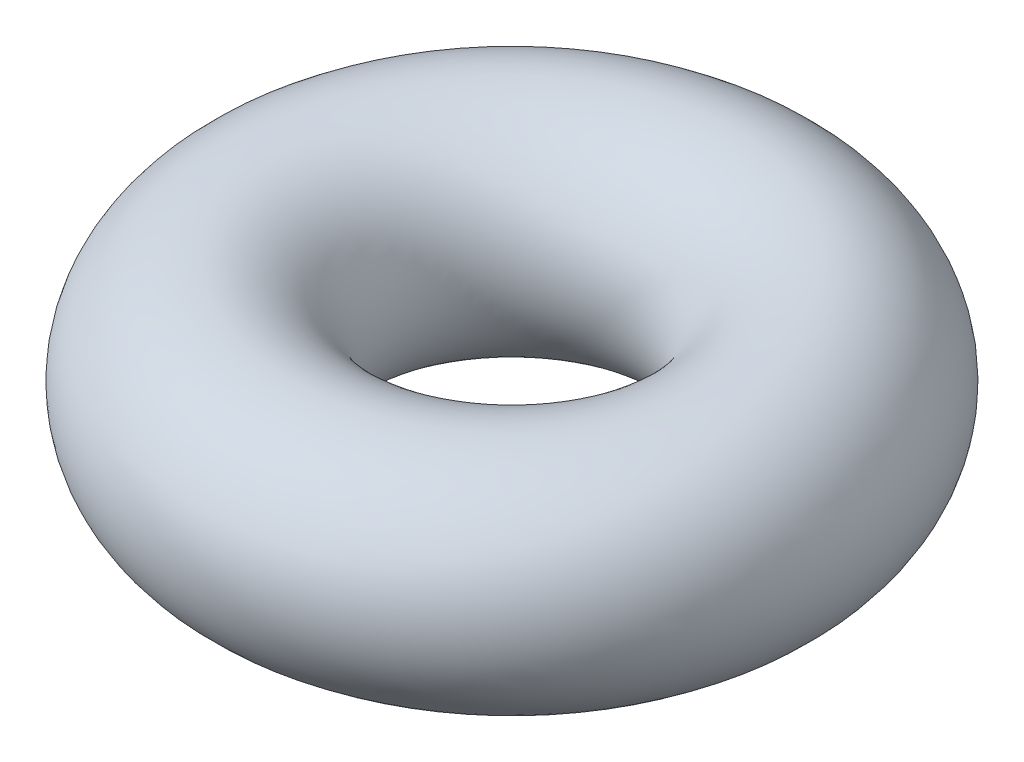
ISO-10303-21;
HEADER;
FILE_DESCRIPTION(('STEP AP214'),'2;1');
FILE_NAME('part.step','',(''),(''),'','','');
FILE_SCHEMA(('AUTOMOTIVE_DESIGN { 1 0 10303 214 1 1 1 1 }'));
ENDSEC;
DATA;
#1=APPLICATION_CONTEXT('core data for automotive mechanical design processes');
#2=APPLICATION_PROTOCOL_DEFINITION('international standard','automotive_design',2000,#1);
#3=PRODUCT_CONTEXT('',#1,'mechanical');
#4=PRODUCT('Part','Part','',(#3));
#5=PRODUCT_RELATED_PRODUCT_CATEGORY('part','',(#4));
#6=PRODUCT_DEFINITION_FORMATION('','',#4);
#7=PRODUCT_DEFINITION_CONTEXT('part definition',#1,'design');
#8=PRODUCT_DEFINITION('design','',#6,#7);
#9=PRODUCT_DEFINITION_SHAPE('','',#8);
#10=(LENGTH_UNIT() NAMED_UNIT(*) SI_UNIT(.MILLI.,.METRE.));
#11=(NAMED_UNIT(*) PLANE_ANGLE_UNIT() SI_UNIT($,.RADIAN.));
#12=(NAMED_UNIT(*) SI_UNIT($,.STERADIAN.) SOLID_ANGLE_UNIT());
#13=UNCERTAINTY_MEASURE_WITH_UNIT(LENGTH_MEASURE(1.E-05),#10,'distance_accuracy_value','');
#14=(GEOMETRIC_REPRESENTATION_CONTEXT(3) GLOBAL_UNCERTAINTY_ASSIGNED_CONTEXT((#13)) GLOBAL_UNIT_ASSIGNED_CONTEXT((#10,
#11,#12)) REPRESENTATION_CONTEXT('',''));
#15=CARTESIAN_POINT('',(0.,0.,0.));
#16=DIRECTION('',(0.,0.,1.));
#17=DIRECTION('',(1.,0.,0.));
#18=AXIS2_PLACEMENT_3D('',#15,#16,#17);
#19=CARTESIAN_POINT('',(0.,0.,0.));
#20=DIRECTION('',(0.,-1.,0.));
#21=DIRECTION('',(0.,0.,-1.));
#22=AXIS2_PLACEMENT_3D('',#19,#20,#21);
#23=TOROIDAL_SURFACE('',#22,1.778,0.889);
#24=CARTESIAN_POINT('',(0.,0.,-2.667));
#25=VERTEX_POINT('',#24);
#26=VERTEX_LOOP('',#25);
#27=FACE_BOUND('',#26,.T.);
#28=ADVANCED_FACE('F33',(#27),#23,.T.);
#29=CLOSED_SHELL('',(#28));
#30=MANIFOLD_SOLID_BREP('B2',#29);
#31=ADVANCED_BREP_SHAPE_REPRESENTATION('',(#18,#30),#14);
#32=SHAPE_DEFINITION_REPRESENTATION(#9,#31);
ENDSEC;
END-ISO-10303-21;
